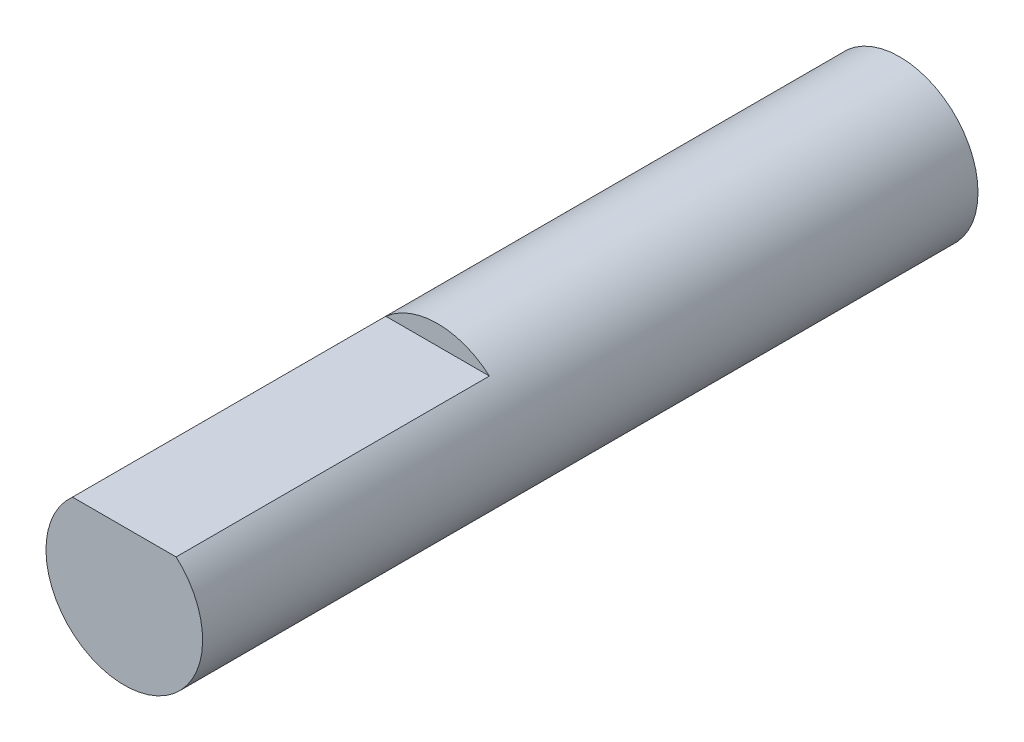
ISO-10303-21;
HEADER;
FILE_DESCRIPTION(('STEP AP214'),'2;1');
FILE_NAME('part.step','',(''),(''),'','','');
FILE_SCHEMA(('AUTOMOTIVE_DESIGN { 1 0 10303 214 1 1 1 1 }'));
ENDSEC;
DATA;
#1=APPLICATION_CONTEXT('core data for automotive mechanical design processes');
#2=APPLICATION_PROTOCOL_DEFINITION('international standard','automotive_design',2000,#1);
#3=PRODUCT_CONTEXT('',#1,'mechanical');
#4=PRODUCT('Part','Part','',(#3));
#5=PRODUCT_RELATED_PRODUCT_CATEGORY('part','',(#4));
#6=PRODUCT_DEFINITION_FORMATION('','',#4);
#7=PRODUCT_DEFINITION_CONTEXT('part definition',#1,'design');
#8=PRODUCT_DEFINITION('design','',#6,#7);
#9=PRODUCT_DEFINITION_SHAPE('','',#8);
#10=(LENGTH_UNIT() NAMED_UNIT(*) SI_UNIT(.MILLI.,.METRE.));
#11=(NAMED_UNIT(*) PLANE_ANGLE_UNIT() SI_UNIT($,.RADIAN.));
#12=(NAMED_UNIT(*) SI_UNIT($,.STERADIAN.) SOLID_ANGLE_UNIT());
#13=UNCERTAINTY_MEASURE_WITH_UNIT(LENGTH_MEASURE(1.E-05),#10,'distance_accuracy_value','');
#14=(GEOMETRIC_REPRESENTATION_CONTEXT(3) GLOBAL_UNCERTAINTY_ASSIGNED_CONTEXT((#13)) GLOBAL_UNIT_ASSIGNED_CONTEXT((#10,
#11,#12)) REPRESENTATION_CONTEXT('',''));
#15=CARTESIAN_POINT('',(0.,0.,0.));
#16=DIRECTION('',(0.,0.,1.));
#17=DIRECTION('',(1.,0.,0.));
#18=AXIS2_PLACEMENT_3D('',#15,#16,#17);
#19=CARTESIAN_POINT('',(0.,0.,19.8));
#20=DIRECTION('',(0.,0.,-1.));
#21=DIRECTION('',(-1.,0.,0.));
#22=AXIS2_PLACEMENT_3D('',#19,#20,#21);
#23=CYLINDRICAL_SURFACE('',#22,2.);
#24=CARTESIAN_POINT('',(0.,0.,0.));
#25=DIRECTION('',(0.,0.,1.));
#26=DIRECTION('',(1.,0.,0.));
#27=AXIS2_PLACEMENT_3D('',#24,#25,#26);
#28=CIRCLE('',#27,2.);
#29=CARTESIAN_POINT('',(2.,0.,0.));
#30=VERTEX_POINT('',#29);
#31=EDGE_CURVE('E42',#30,#30,#28,.T.);
#32=ORIENTED_EDGE('',*,*,#31,.T.);
#33=EDGE_LOOP('',(#32));
#34=FACE_BOUND('',#33,.T.);
#35=DIRECTION('',(0.,0.,-1.));
#36=VECTOR('',#35,1.);
#37=CARTESIAN_POINT('',(1.3228756555323,1.5,45.5402894311622));
#38=LINE('',#37,#36);
#39=CARTESIAN_POINT('',(1.3228756555323,1.5,19.8));
#40=VERTEX_POINT('',#39);
#41=CARTESIAN_POINT('',(1.3228756555323,1.5,11.8));
#42=VERTEX_POINT('',#41);
#43=EDGE_CURVE('E71',#40,#42,#38,.T.);
#44=ORIENTED_EDGE('',*,*,#43,.F.);
#45=CARTESIAN_POINT('',(0.,0.,19.8));
#46=DIRECTION('',(0.,0.,1.));
#47=DIRECTION('',(1.,0.,0.));
#48=AXIS2_PLACEMENT_3D('',#45,#46,#47);
#49=CIRCLE('',#48,2.);
#50=CARTESIAN_POINT('',(-1.3228756555323,1.5,19.8));
#51=VERTEX_POINT('',#50);
#52=EDGE_CURVE('E11',#51,#40,#49,.T.);
#53=ORIENTED_EDGE('',*,*,#52,.F.);
#54=DIRECTION('',(0.,0.,-1.));
#55=VECTOR('',#54,1.);
#56=CARTESIAN_POINT('',(-1.3228756555323,1.5,45.5402894311622));
#57=LINE('',#56,#55);
#58=CARTESIAN_POINT('',(-1.3228756555323,1.5,11.8));
#59=VERTEX_POINT('',#58);
#60=EDGE_CURVE('E54',#51,#59,#57,.T.);
#61=ORIENTED_EDGE('',*,*,#60,.T.);
#62=CARTESIAN_POINT('',(0.,0.,11.8));
#63=DIRECTION('',(0.,0.,1.));
#64=DIRECTION('',(1.,0.,0.));
#65=AXIS2_PLACEMENT_3D('',#62,#63,#64);
#66=CIRCLE('',#65,2.);
#67=EDGE_CURVE('E69',#42,#59,#66,.T.);
#68=ORIENTED_EDGE('',*,*,#67,.F.);
#69=EDGE_LOOP('',(#44,#53,#61,#68));
#70=FACE_BOUND('',#69,.T.);
#71=ADVANCED_FACE('F39',(#34,#70),#23,.T.);
#72=CARTESIAN_POINT('',(0.,0.,19.8));
#73=DIRECTION('',(0.,0.,1.));
#74=DIRECTION('',(1.,0.,0.));
#75=AXIS2_PLACEMENT_3D('',#72,#73,#74);
#76=PLANE('',#75);
#77=ORIENTED_EDGE('',*,*,#52,.T.);
#78=DIRECTION('',(1.,0.,0.));
#79=VECTOR('',#78,1.);
#80=CARTESIAN_POINT('',(-1.3228756555323,1.5,19.8));
#81=LINE('',#80,#79);
#82=EDGE_CURVE('E58',#51,#40,#81,.T.);
#83=ORIENTED_EDGE('',*,*,#82,.F.);
#84=EDGE_LOOP('',(#77,#83));
#85=FACE_BOUND('',#84,.T.);
#86=ADVANCED_FACE('F91',(#85),#76,.T.);
#87=CARTESIAN_POINT('',(0.,0.,0.));
#88=DIRECTION('',(0.,0.,1.));
#89=DIRECTION('',(1.,0.,0.));
#90=AXIS2_PLACEMENT_3D('',#87,#88,#89);
#91=PLANE('',#90);
#92=ORIENTED_EDGE('',*,*,#31,.F.);
#93=EDGE_LOOP('',(#92));
#94=FACE_BOUND('',#93,.T.);
#95=ADVANCED_FACE('F89',(#94),#91,.F.);
#96=CARTESIAN_POINT('',(-1.3228756555323,1.5,45.5402894311622));
#97=DIRECTION('',(0.,1.,0.));
#98=DIRECTION('',(0.,0.,1.));
#99=AXIS2_PLACEMENT_3D('',#96,#97,#98);
#100=PLANE('',#99);
#101=ORIENTED_EDGE('',*,*,#60,.F.);
#102=ORIENTED_EDGE('',*,*,#82,.T.);
#103=ORIENTED_EDGE('',*,*,#43,.T.);
#104=DIRECTION('',(1.,0.,0.));
#105=VECTOR('',#104,1.);
#106=CARTESIAN_POINT('',(-1.3228756555323,1.5,11.8));
#107=LINE('',#106,#105);
#108=EDGE_CURVE('E66',#59,#42,#107,.T.);
#109=ORIENTED_EDGE('',*,*,#108,.F.);
#110=EDGE_LOOP('',(#101,#102,#103,#109));
#111=FACE_BOUND('',#110,.T.);
#112=ADVANCED_FACE('F73',(#111),#100,.T.);
#113=CARTESIAN_POINT('',(0.,0.,11.8));
#114=DIRECTION('',(0.,0.,1.));
#115=DIRECTION('',(1.,0.,0.));
#116=AXIS2_PLACEMENT_3D('',#113,#114,#115);
#117=PLANE('',#116);
#118=ORIENTED_EDGE('',*,*,#108,.T.);
#119=ORIENTED_EDGE('',*,*,#67,.T.);
#120=EDGE_LOOP('',(#118,#119));
#121=FACE_BOUND('',#120,.T.);
#122=ADVANCED_FACE('F67',(#121),#117,.T.);
#123=CLOSED_SHELL('',(#71,#86,#95,#112,#122));
#124=MANIFOLD_SOLID_BREP('B2',#123);
#125=ADVANCED_BREP_SHAPE_REPRESENTATION('',(#18,#124),#14);
#126=SHAPE_DEFINITION_REPRESENTATION(#9,#125);
ENDSEC;
END-ISO-10303-21;
